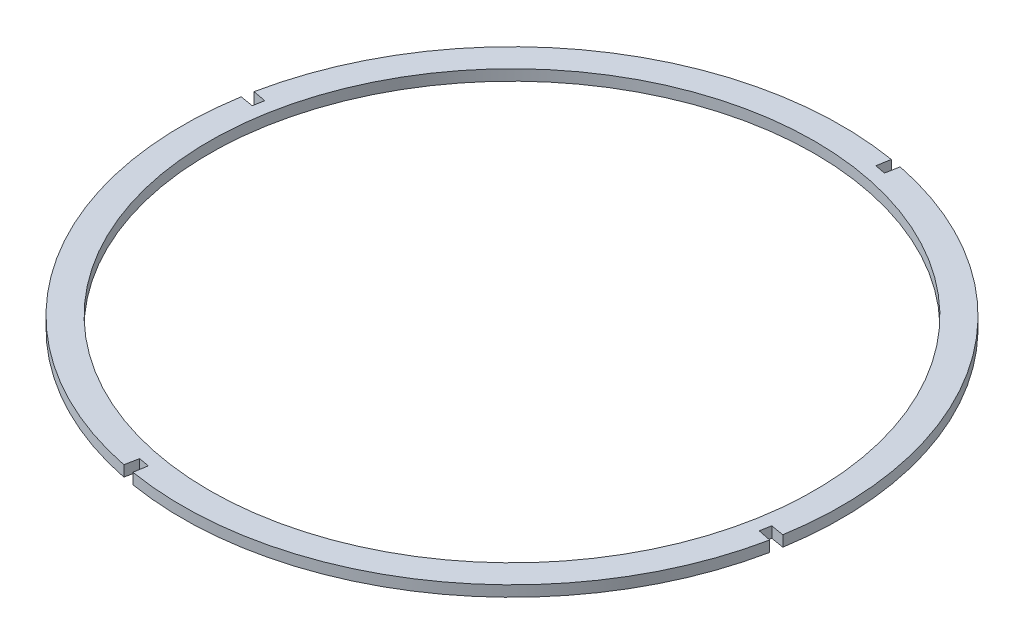
ISO-10303-21;
HEADER;
FILE_DESCRIPTION(('STEP AP214'),'2;1');
FILE_NAME('part.step','',(''),(''),'','','');
FILE_SCHEMA(('AUTOMOTIVE_DESIGN { 1 0 10303 214 1 1 1 1 }'));
ENDSEC;
DATA;
#1=APPLICATION_CONTEXT('core data for automotive mechanical design processes');
#2=APPLICATION_PROTOCOL_DEFINITION('international standard','automotive_design',2000,#1);
#3=PRODUCT_CONTEXT('',#1,'mechanical');
#4=PRODUCT('Part','Part','',(#3));
#5=PRODUCT_RELATED_PRODUCT_CATEGORY('part','',(#4));
#6=PRODUCT_DEFINITION_FORMATION('','',#4);
#7=PRODUCT_DEFINITION_CONTEXT('part definition',#1,'design');
#8=PRODUCT_DEFINITION('design','',#6,#7);
#9=PRODUCT_DEFINITION_SHAPE('','',#8);
#10=(LENGTH_UNIT() NAMED_UNIT(*) SI_UNIT(.MILLI.,.METRE.));
#11=(NAMED_UNIT(*) PLANE_ANGLE_UNIT() SI_UNIT($,.RADIAN.));
#12=(NAMED_UNIT(*) SI_UNIT($,.STERADIAN.) SOLID_ANGLE_UNIT());
#13=UNCERTAINTY_MEASURE_WITH_UNIT(LENGTH_MEASURE(1.E-05),#10,'distance_accuracy_value','');
#14=(GEOMETRIC_REPRESENTATION_CONTEXT(3) GLOBAL_UNCERTAINTY_ASSIGNED_CONTEXT((#13)) GLOBAL_UNIT_ASSIGNED_CONTEXT((#10,
#11,#12)) REPRESENTATION_CONTEXT('',''));
#15=CARTESIAN_POINT('',(0.,0.,0.));
#16=DIRECTION('',(0.,0.,1.));
#17=DIRECTION('',(1.,0.,0.));
#18=AXIS2_PLACEMENT_3D('',#15,#16,#17);
#19=CARTESIAN_POINT('',(-421.491491691804,16.,-176.360021806864));
#20=DIRECTION('',(0.,1.,0.));
#21=DIRECTION('',(0.,0.,1.));
#22=AXIS2_PLACEMENT_3D('',#19,#20,#21);
#23=PLANE('',#22);
#24=DIRECTION('',(0.164606603428678,0.,-0.986359298687691));
#25=VECTOR('',#24,1.);
#26=CARTESIAN_POINT('',(-344.329139140304,16.,-638.733962842383));
#27=LINE('',#26,#25);
#28=CARTESIAN_POINT('',(-344.329139140304,16.,-638.733962842383));
#29=VERTEX_POINT('',#28);
#30=CARTESIAN_POINT('',(-341.048244596208,16.,-658.393811075538));
#31=VERTEX_POINT('',#30);
#32=EDGE_CURVE('E242',#29,#31,#27,.T.);
#33=ORIENTED_EDGE('',*,*,#32,.T.);
#34=CARTESIAN_POINT('',(-421.491491691804,16.,-176.360021806864));
#35=DIRECTION('',(0.,1.,0.));
#36=DIRECTION('',(0.,0.,1.));
#37=AXIS2_PLACEMENT_3D('',#34,#35,#36);
#38=CIRCLE('',#37,488.7);
#39=CARTESIAN_POINT('',(-900.566511143055,16.,-272.87331486944));
#40=VERTEX_POINT('',#39);
#41=EDGE_CURVE('E130',#31,#40,#38,.T.);
#42=ORIENTED_EDGE('',*,*,#41,.T.);
#43=DIRECTION('',(0.983406473892088,0.,0.181415840287255));
#44=VECTOR('',#43,1.);
#45=CARTESIAN_POINT('',(-880.962779282727,16.,-269.256877940637));
#46=LINE('',#45,#44);
#47=CARTESIAN_POINT('',(-880.962779282727,16.,-269.256877940637));
#48=VERTEX_POINT('',#47);
#49=EDGE_CURVE('E295',#40,#48,#46,.T.);
#50=ORIENTED_EDGE('',*,*,#49,.T.);
#51=DIRECTION('',(-0.181415840287255,0.,0.983406473892088));
#52=VECTOR('',#51,1.);
#53=CARTESIAN_POINT('',(-880.962779282727,16.,-269.256877940637));
#54=LINE('',#53,#52);
#55=CARTESIAN_POINT('',(-883.865432727323,16.,-253.522374358363));
#56=VERTEX_POINT('',#55);
#57=EDGE_CURVE('E315',#48,#56,#54,.T.);
#58=ORIENTED_EDGE('',*,*,#57,.T.);
#59=DIRECTION('',(-0.986359298687691,0.,-0.164606603428678));
#60=VECTOR('',#59,1.);
#61=CARTESIAN_POINT('',(-883.865432727323,16.,-253.522374358363));
#62=LINE('',#61,#60);
#63=CARTESIAN_POINT('',(-903.525280960478,16.,-256.803268902459));
#64=VERTEX_POINT('',#63);
#65=EDGE_CURVE('E311',#56,#64,#62,.T.);
#66=ORIENTED_EDGE('',*,*,#65,.T.);
#67=CARTESIAN_POINT('',(-421.491491691804,16.,-176.360021806864));
#68=DIRECTION('',(0.,1.,0.));
#69=DIRECTION('',(0.,0.,1.));
#70=AXIS2_PLACEMENT_3D('',#67,#68,#69);
#71=CIRCLE('',#70,488.7);
#72=CARTESIAN_POINT('',(-518.061372416088,16.,302.703594153374));
#73=VERTEX_POINT('',#72);
#74=EDGE_CURVE('E314',#64,#73,#71,.T.);
#75=ORIENTED_EDGE('',*,*,#74,.T.);
#76=DIRECTION('',(0.197605649118648,0.,-0.980281595989845));
#77=VECTOR('',#76,1.);
#78=CARTESIAN_POINT('',(-514.122296759583,16.,283.162637766215));
#79=LINE('',#78,#77);
#80=CARTESIAN_POINT('',(-514.122296759583,16.,283.162637766215));
#81=VERTEX_POINT('',#80);
#82=EDGE_CURVE('E319',#73,#81,#79,.T.);
#83=ORIENTED_EDGE('',*,*,#82,.T.);
#84=DIRECTION('',(0.983458871104074,0.,0.181131578822413));
#85=VECTOR('',#84,1.);
#86=CARTESIAN_POINT('',(-514.122296759583,16.,283.162637766215));
#87=LINE('',#86,#85);
#88=CARTESIAN_POINT('',(-498.386954821918,16.,286.060743027374));
#89=VERTEX_POINT('',#88);
#90=EDGE_CURVE('E326',#81,#89,#87,.T.);
#91=ORIENTED_EDGE('',*,*,#90,.T.);
#92=DIRECTION('',(-0.164036445607693,0.,0.986454278977183));
#93=VECTOR('',#92,1.);
#94=CARTESIAN_POINT('',(-498.386954821918,16.,286.060743027374));
#95=LINE('',#94,#93);
#96=CARTESIAN_POINT('',(-501.656102660317,16.,305.72018432928));
#97=VERTEX_POINT('',#96);
#98=EDGE_CURVE('E329',#89,#97,#95,.T.);
#99=ORIENTED_EDGE('',*,*,#98,.T.);
#100=CARTESIAN_POINT('',(-421.491491691804,16.,-176.360021806864));
#101=DIRECTION('',(0.,1.,0.));
#102=DIRECTION('',(0.,0.,1.));
#103=AXIS2_PLACEMENT_3D('',#100,#101,#102);
#104=CIRCLE('',#103,488.7);
#105=CARTESIAN_POINT('',(57.51622513927,16.,-79.5132499645258));
#106=VERTEX_POINT('',#105);
#107=EDGE_CURVE('E332',#97,#106,#104,.T.);
#108=ORIENTED_EDGE('',*,*,#107,.T.);
#109=DIRECTION('',(-0.980167212668455,0.,-0.198172236223321));
#110=VECTOR('',#109,1.);
#111=CARTESIAN_POINT('',(37.9797958991198,16.,-83.4631656730905));
#112=LINE('',#111,#110);
#113=CARTESIAN_POINT('',(37.9797958991198,16.,-83.4631656730905));
#114=VERTEX_POINT('',#113);
#115=EDGE_CURVE('E335',#106,#114,#112,.T.);
#116=ORIENTED_EDGE('',*,*,#115,.T.);
#117=DIRECTION('',(0.181415840287254,0.,-0.983406473892088));
#118=VECTOR('',#117,1.);
#119=CARTESIAN_POINT('',(40.8824493437158,16.,-99.1976692553639));
#120=LINE('',#119,#118);
#121=CARTESIAN_POINT('',(40.8824493437158,16.,-99.1976692553639));
#122=VERTEX_POINT('',#121);
#123=EDGE_CURVE('E338',#114,#122,#120,.T.);
#124=ORIENTED_EDGE('',*,*,#123,.T.);
#125=DIRECTION('',(0.986359298687691,0.,0.164606603428679));
#126=VECTOR('',#125,1.);
#127=CARTESIAN_POINT('',(40.8824493437158,16.,-99.1976692553639));
#128=LINE('',#127,#126);
#129=CARTESIAN_POINT('',(60.5422975768707,16.,-95.9167747112677));
#130=VERTEX_POINT('',#129);
#131=EDGE_CURVE('E173',#122,#130,#128,.T.);
#132=ORIENTED_EDGE('',*,*,#131,.T.);
#133=CARTESIAN_POINT('',(-421.491491691804,16.,-176.360021806864));
#134=DIRECTION('',(0.,1.,0.));
#135=DIRECTION('',(0.,0.,1.));
#136=AXIS2_PLACEMENT_3D('',#133,#134,#135);
#137=CIRCLE('',#136,488.7);
#138=CARTESIAN_POINT('',(-324.978198629227,16.,-655.435041258115));
#139=VERTEX_POINT('',#138);
#140=EDGE_CURVE('E167',#130,#139,#137,.T.);
#141=ORIENTED_EDGE('',*,*,#140,.T.);
#142=DIRECTION('',(-0.181415840287261,0.,0.983406473892087));
#143=VECTOR('',#142,1.);
#144=CARTESIAN_POINT('',(-328.594635558031,16.,-635.831309397787));
#145=LINE('',#144,#143);
#146=CARTESIAN_POINT('',(-328.594635558031,16.,-635.831309397787));
#147=VERTEX_POINT('',#146);
#148=EDGE_CURVE('E171',#139,#147,#145,.T.);
#149=ORIENTED_EDGE('',*,*,#148,.T.);
#150=DIRECTION('',(-0.983406473892088,0.,-0.181415840287254));
#151=VECTOR('',#150,1.);
#152=CARTESIAN_POINT('',(-344.329139140304,16.,-638.733962842383));
#153=LINE('',#152,#151);
#154=EDGE_CURVE('E63',#147,#29,#153,.T.);
#155=ORIENTED_EDGE('',*,*,#154,.T.);
#156=EDGE_LOOP('',(#33,#42,#50,#58,#66,#75,#83,#91,#99,#108,#116,#124,#132,#141,#149,#155));
#157=FACE_BOUND('',#156,.T.);
#158=CARTESIAN_POINT('',(-421.491491691804,16.,-176.360021806864));
#159=DIRECTION('',(0.,1.,0.));
#160=DIRECTION('',(0.,0.,1.));
#161=AXIS2_PLACEMENT_3D('',#158,#159,#160);
#162=CIRCLE('',#161,448.7);
#163=CARTESIAN_POINT('',(-421.491491691804,16.,272.339978193137));
#164=VERTEX_POINT('',#163);
#165=EDGE_CURVE('E200',#164,#164,#162,.T.);
#166=ORIENTED_EDGE('',*,*,#165,.F.);
#167=EDGE_LOOP('',(#166));
#168=FACE_BOUND('',#167,.T.);
#169=ADVANCED_FACE('F45',(#157,#168),#23,.T.);
#170=CARTESIAN_POINT('',(-421.491491691804,0.,-176.360021806864));
#171=DIRECTION('',(0.,1.,0.));
#172=DIRECTION('',(0.,0.,1.));
#173=AXIS2_PLACEMENT_3D('',#170,#171,#172);
#174=PLANE('',#173);
#175=DIRECTION('',(0.164606603428678,0.,-0.986359298687691));
#176=VECTOR('',#175,1.);
#177=CARTESIAN_POINT('',(-344.329139140304,0.,-638.733962842383));
#178=LINE('',#177,#176);
#179=CARTESIAN_POINT('',(-344.329139140304,0.,-638.733962842383));
#180=VERTEX_POINT('',#179);
#181=CARTESIAN_POINT('',(-341.048244596208,0.,-658.393811075538));
#182=VERTEX_POINT('',#181);
#183=EDGE_CURVE('E195',#180,#182,#178,.T.);
#184=ORIENTED_EDGE('',*,*,#183,.F.);
#185=DIRECTION('',(-0.983406473892088,0.,-0.181415840287254));
#186=VECTOR('',#185,1.);
#187=CARTESIAN_POINT('',(-344.329139140304,0.,-638.733962842383));
#188=LINE('',#187,#186);
#189=CARTESIAN_POINT('',(-328.594635558031,0.,-635.831309397787));
#190=VERTEX_POINT('',#189);
#191=EDGE_CURVE('E122',#190,#180,#188,.T.);
#192=ORIENTED_EDGE('',*,*,#191,.F.);
#193=DIRECTION('',(-0.181415840287261,0.,0.983406473892087));
#194=VECTOR('',#193,1.);
#195=CARTESIAN_POINT('',(-328.594635558031,0.,-635.831309397787));
#196=LINE('',#195,#194);
#197=CARTESIAN_POINT('',(-324.978198629227,0.,-655.435041258115));
#198=VERTEX_POINT('',#197);
#199=EDGE_CURVE('E116',#198,#190,#196,.T.);
#200=ORIENTED_EDGE('',*,*,#199,.F.);
#201=CARTESIAN_POINT('',(-421.491491691804,0.,-176.360021806864));
#202=DIRECTION('',(0.,1.,0.));
#203=DIRECTION('',(0.,0.,1.));
#204=AXIS2_PLACEMENT_3D('',#201,#202,#203);
#205=CIRCLE('',#204,488.7);
#206=CARTESIAN_POINT('',(60.5422975768707,0.,-95.9167747112677));
#207=VERTEX_POINT('',#206);
#208=EDGE_CURVE('E182',#207,#198,#205,.T.);
#209=ORIENTED_EDGE('',*,*,#208,.F.);
#210=DIRECTION('',(0.986359298687691,0.,0.164606603428679));
#211=VECTOR('',#210,1.);
#212=CARTESIAN_POINT('',(40.8824493437158,0.,-99.1976692553639));
#213=LINE('',#212,#211);
#214=CARTESIAN_POINT('',(40.8824493437158,0.,-99.1976692553639));
#215=VERTEX_POINT('',#214);
#216=EDGE_CURVE('E233',#215,#207,#213,.T.);
#217=ORIENTED_EDGE('',*,*,#216,.F.);
#218=DIRECTION('',(0.181415840287254,0.,-0.983406473892088));
#219=VECTOR('',#218,1.);
#220=CARTESIAN_POINT('',(40.8824493437158,0.,-99.1976692553639));
#221=LINE('',#220,#219);
#222=CARTESIAN_POINT('',(37.9797958991198,0.,-83.4631656730905));
#223=VERTEX_POINT('',#222);
#224=EDGE_CURVE('E230',#223,#215,#221,.T.);
#225=ORIENTED_EDGE('',*,*,#224,.F.);
#226=DIRECTION('',(-0.980167212668455,0.,-0.198172236223321));
#227=VECTOR('',#226,1.);
#228=CARTESIAN_POINT('',(37.9797958991198,0.,-83.4631656730905));
#229=LINE('',#228,#227);
#230=CARTESIAN_POINT('',(57.51622513927,0.,-79.5132499645258));
#231=VERTEX_POINT('',#230);
#232=EDGE_CURVE('E227',#231,#223,#229,.T.);
#233=ORIENTED_EDGE('',*,*,#232,.F.);
#234=CARTESIAN_POINT('',(-421.491491691804,0.,-176.360021806864));
#235=DIRECTION('',(0.,1.,0.));
#236=DIRECTION('',(0.,0.,1.));
#237=AXIS2_PLACEMENT_3D('',#234,#235,#236);
#238=CIRCLE('',#237,488.7);
#239=CARTESIAN_POINT('',(-501.656102660317,0.,305.72018432928));
#240=VERTEX_POINT('',#239);
#241=EDGE_CURVE('E224',#240,#231,#238,.T.);
#242=ORIENTED_EDGE('',*,*,#241,.F.);
#243=DIRECTION('',(-0.164036445607693,0.,0.986454278977183));
#244=VECTOR('',#243,1.);
#245=CARTESIAN_POINT('',(-498.386954821918,0.,286.060743027374));
#246=LINE('',#245,#244);
#247=CARTESIAN_POINT('',(-498.386954821918,0.,286.060743027374));
#248=VERTEX_POINT('',#247);
#249=EDGE_CURVE('E221',#248,#240,#246,.T.);
#250=ORIENTED_EDGE('',*,*,#249,.F.);
#251=DIRECTION('',(0.983458871104074,0.,0.181131578822413));
#252=VECTOR('',#251,1.);
#253=CARTESIAN_POINT('',(-514.122296759583,0.,283.162637766215));
#254=LINE('',#253,#252);
#255=CARTESIAN_POINT('',(-514.122296759583,0.,283.162637766215));
#256=VERTEX_POINT('',#255);
#257=EDGE_CURVE('E218',#256,#248,#254,.T.);
#258=ORIENTED_EDGE('',*,*,#257,.F.);
#259=DIRECTION('',(0.197605649118648,0.,-0.980281595989845));
#260=VECTOR('',#259,1.);
#261=CARTESIAN_POINT('',(-514.122296759583,0.,283.162637766215));
#262=LINE('',#261,#260);
#263=CARTESIAN_POINT('',(-518.061372416088,0.,302.703594153374));
#264=VERTEX_POINT('',#263);
#265=EDGE_CURVE('E215',#264,#256,#262,.T.);
#266=ORIENTED_EDGE('',*,*,#265,.F.);
#267=CARTESIAN_POINT('',(-421.491491691804,0.,-176.360021806864));
#268=DIRECTION('',(0.,1.,0.));
#269=DIRECTION('',(0.,0.,1.));
#270=AXIS2_PLACEMENT_3D('',#267,#268,#269);
#271=CIRCLE('',#270,488.7);
#272=CARTESIAN_POINT('',(-903.525280960478,0.,-256.803268902459));
#273=VERTEX_POINT('',#272);
#274=EDGE_CURVE('E212',#273,#264,#271,.T.);
#275=ORIENTED_EDGE('',*,*,#274,.F.);
#276=DIRECTION('',(-0.986359298687691,0.,-0.164606603428678));
#277=VECTOR('',#276,1.);
#278=CARTESIAN_POINT('',(-883.865432727323,0.,-253.522374358363));
#279=LINE('',#278,#277);
#280=CARTESIAN_POINT('',(-883.865432727323,0.,-253.522374358363));
#281=VERTEX_POINT('',#280);
#282=EDGE_CURVE('E209',#281,#273,#279,.T.);
#283=ORIENTED_EDGE('',*,*,#282,.F.);
#284=DIRECTION('',(-0.181415840287255,0.,0.983406473892088));
#285=VECTOR('',#284,1.);
#286=CARTESIAN_POINT('',(-880.962779282727,0.,-269.256877940637));
#287=LINE('',#286,#285);
#288=CARTESIAN_POINT('',(-880.962779282727,0.,-269.256877940637));
#289=VERTEX_POINT('',#288);
#290=EDGE_CURVE('E206',#289,#281,#287,.T.);
#291=ORIENTED_EDGE('',*,*,#290,.F.);
#292=DIRECTION('',(0.983406473892088,0.,0.181415840287255));
#293=VECTOR('',#292,1.);
#294=CARTESIAN_POINT('',(-880.962779282727,0.,-269.256877940637));
#295=LINE('',#294,#293);
#296=CARTESIAN_POINT('',(-900.566511143055,0.,-272.87331486944));
#297=VERTEX_POINT('',#296);
#298=EDGE_CURVE('E203',#297,#289,#295,.T.);
#299=ORIENTED_EDGE('',*,*,#298,.F.);
#300=CARTESIAN_POINT('',(-421.491491691804,0.,-176.360021806864));
#301=DIRECTION('',(0.,1.,0.));
#302=DIRECTION('',(0.,0.,1.));
#303=AXIS2_PLACEMENT_3D('',#300,#301,#302);
#304=CIRCLE('',#303,488.7);
#305=EDGE_CURVE('E199',#182,#297,#304,.T.);
#306=ORIENTED_EDGE('',*,*,#305,.F.);
#307=EDGE_LOOP('',(#184,#192,#200,#209,#217,#225,#233,#242,#250,#258,#266,#275,#283,#291,#299,#306));
#308=FACE_BOUND('',#307,.T.);
#309=CARTESIAN_POINT('',(-421.491491691804,0.,-176.360021806864));
#310=DIRECTION('',(0.,1.,0.));
#311=DIRECTION('',(0.,0.,1.));
#312=AXIS2_PLACEMENT_3D('',#309,#310,#311);
#313=CIRCLE('',#312,448.7);
#314=CARTESIAN_POINT('',(-421.491491691804,0.,272.339978193137));
#315=VERTEX_POINT('',#314);
#316=EDGE_CURVE('E539',#315,#315,#313,.T.);
#317=ORIENTED_EDGE('',*,*,#316,.T.);
#318=EDGE_LOOP('',(#317));
#319=FACE_BOUND('',#318,.T.);
#320=ADVANCED_FACE('F299',(#308,#319),#174,.F.);
#321=CARTESIAN_POINT('',(-344.329139140304,16.,-638.733962842383));
#322=DIRECTION('',(-0.986359298687691,0.,-0.164606603428678));
#323=DIRECTION('',(-0.164606603428678,0.,0.986359298687691));
#324=AXIS2_PLACEMENT_3D('',#321,#322,#323);
#325=PLANE('',#324);
#326=ORIENTED_EDGE('',*,*,#183,.T.);
#327=DIRECTION('',(0.,-1.,0.));
#328=VECTOR('',#327,1.);
#329=CARTESIAN_POINT('',(-341.048244596208,16.,-658.393811075538));
#330=LINE('',#329,#328);
#331=EDGE_CURVE('E11',#31,#182,#330,.T.);
#332=ORIENTED_EDGE('',*,*,#331,.F.);
#333=ORIENTED_EDGE('',*,*,#32,.F.);
#334=DIRECTION('',(0.,-1.,0.));
#335=VECTOR('',#334,1.);
#336=CARTESIAN_POINT('',(-344.329139140304,16.,-638.733962842383));
#337=LINE('',#336,#335);
#338=EDGE_CURVE('E191',#29,#180,#337,.T.);
#339=ORIENTED_EDGE('',*,*,#338,.T.);
#340=EDGE_LOOP('',(#326,#332,#333,#339));
#341=FACE_BOUND('',#340,.T.);
#342=ADVANCED_FACE('F47',(#341),#325,.F.);
#343=CARTESIAN_POINT('',(-421.491491691804,16.,-176.360021806864));
#344=DIRECTION('',(0.,-1.,0.));
#345=DIRECTION('',(0.,0.,-1.));
#346=AXIS2_PLACEMENT_3D('',#343,#344,#345);
#347=CYLINDRICAL_SURFACE('',#346,488.7);
#348=ORIENTED_EDGE('',*,*,#305,.T.);
#349=DIRECTION('',(0.,-1.,0.));
#350=VECTOR('',#349,1.);
#351=CARTESIAN_POINT('',(-900.566511143055,16.,-272.87331486944));
#352=LINE('',#351,#350);
#353=EDGE_CURVE('E55',#40,#297,#352,.T.);
#354=ORIENTED_EDGE('',*,*,#353,.F.);
#355=ORIENTED_EDGE('',*,*,#41,.F.);
#356=ORIENTED_EDGE('',*,*,#331,.T.);
#357=EDGE_LOOP('',(#348,#354,#355,#356));
#358=FACE_BOUND('',#357,.T.);
#359=ADVANCED_FACE('F374',(#358),#347,.T.);
#360=CARTESIAN_POINT('',(-880.962779282727,16.,-269.256877940637));
#361=DIRECTION('',(0.181415840287255,0.,-0.983406473892088));
#362=DIRECTION('',(-0.983406473892088,0.,-0.181415840287255));
#363=AXIS2_PLACEMENT_3D('',#360,#361,#362);
#364=PLANE('',#363);
#365=ORIENTED_EDGE('',*,*,#298,.T.);
#366=DIRECTION('',(0.,-1.,0.));
#367=VECTOR('',#366,1.);
#368=CARTESIAN_POINT('',(-880.962779282727,16.,-269.256877940637));
#369=LINE('',#368,#367);
#370=EDGE_CURVE('E285',#48,#289,#369,.T.);
#371=ORIENTED_EDGE('',*,*,#370,.F.);
#372=ORIENTED_EDGE('',*,*,#49,.F.);
#373=ORIENTED_EDGE('',*,*,#353,.T.);
#374=EDGE_LOOP('',(#365,#371,#372,#373));
#375=FACE_BOUND('',#374,.T.);
#376=ADVANCED_FACE('F293',(#375),#364,.F.);
#377=CARTESIAN_POINT('',(-880.962779282727,16.,-269.256877940637));
#378=DIRECTION('',(0.983406473892088,0.,0.181415840287255));
#379=DIRECTION('',(0.181415840287255,0.,-0.983406473892088));
#380=AXIS2_PLACEMENT_3D('',#377,#378,#379);
#381=PLANE('',#380);
#382=ORIENTED_EDGE('',*,*,#290,.T.);
#383=DIRECTION('',(0.,-1.,0.));
#384=VECTOR('',#383,1.);
#385=CARTESIAN_POINT('',(-883.865432727323,16.,-253.522374358363));
#386=LINE('',#385,#384);
#387=EDGE_CURVE('E281',#56,#281,#386,.T.);
#388=ORIENTED_EDGE('',*,*,#387,.F.);
#389=ORIENTED_EDGE('',*,*,#57,.F.);
#390=ORIENTED_EDGE('',*,*,#370,.T.);
#391=EDGE_LOOP('',(#382,#388,#389,#390));
#392=FACE_BOUND('',#391,.T.);
#393=ADVANCED_FACE('F305',(#392),#381,.F.);
#394=CARTESIAN_POINT('',(-883.865432727323,16.,-253.522374358363));
#395=DIRECTION('',(-0.164606603428678,0.,0.986359298687691));
#396=DIRECTION('',(0.986359298687691,0.,0.164606603428678));
#397=AXIS2_PLACEMENT_3D('',#394,#395,#396);
#398=PLANE('',#397);
#399=ORIENTED_EDGE('',*,*,#282,.T.);
#400=DIRECTION('',(0.,-1.,0.));
#401=VECTOR('',#400,1.);
#402=CARTESIAN_POINT('',(-903.525280960478,16.,-256.803268902459));
#403=LINE('',#402,#401);
#404=EDGE_CURVE('E277',#64,#273,#403,.T.);
#405=ORIENTED_EDGE('',*,*,#404,.F.);
#406=ORIENTED_EDGE('',*,*,#65,.F.);
#407=ORIENTED_EDGE('',*,*,#387,.T.);
#408=EDGE_LOOP('',(#399,#405,#406,#407));
#409=FACE_BOUND('',#408,.T.);
#410=ADVANCED_FACE('F309',(#409),#398,.F.);
#411=CARTESIAN_POINT('',(-421.491491691804,16.,-176.360021806864));
#412=DIRECTION('',(0.,-1.,0.));
#413=DIRECTION('',(0.,0.,-1.));
#414=AXIS2_PLACEMENT_3D('',#411,#412,#413);
#415=CYLINDRICAL_SURFACE('',#414,488.7);
#416=ORIENTED_EDGE('',*,*,#274,.T.);
#417=DIRECTION('',(0.,-1.,0.));
#418=VECTOR('',#417,1.);
#419=CARTESIAN_POINT('',(-518.061372416088,16.,302.703594153374));
#420=LINE('',#419,#418);
#421=EDGE_CURVE('E273',#73,#264,#420,.T.);
#422=ORIENTED_EDGE('',*,*,#421,.F.);
#423=ORIENTED_EDGE('',*,*,#74,.F.);
#424=ORIENTED_EDGE('',*,*,#404,.T.);
#425=EDGE_LOOP('',(#416,#422,#423,#424));
#426=FACE_BOUND('',#425,.T.);
#427=ADVANCED_FACE('F387',(#426),#415,.T.);
#428=CARTESIAN_POINT('',(-514.122296759583,16.,283.162637766215));
#429=DIRECTION('',(-0.980281595989845,0.,-0.197605649118648));
#430=DIRECTION('',(-0.197605649118648,0.,0.980281595989845));
#431=AXIS2_PLACEMENT_3D('',#428,#429,#430);
#432=PLANE('',#431);
#433=ORIENTED_EDGE('',*,*,#265,.T.);
#434=DIRECTION('',(0.,-1.,0.));
#435=VECTOR('',#434,1.);
#436=CARTESIAN_POINT('',(-514.122296759583,16.,283.162637766215));
#437=LINE('',#436,#435);
#438=EDGE_CURVE('E269',#81,#256,#437,.T.);
#439=ORIENTED_EDGE('',*,*,#438,.F.);
#440=ORIENTED_EDGE('',*,*,#82,.F.);
#441=ORIENTED_EDGE('',*,*,#421,.T.);
#442=EDGE_LOOP('',(#433,#439,#440,#441));
#443=FACE_BOUND('',#442,.T.);
#444=ADVANCED_FACE('F390',(#443),#432,.F.);
#445=CARTESIAN_POINT('',(-514.122296759583,16.,283.162637766215));
#446=DIRECTION('',(0.181131578822413,0.,-0.983458871104074));
#447=DIRECTION('',(-0.983458871104074,0.,-0.181131578822413));
#448=AXIS2_PLACEMENT_3D('',#445,#446,#447);
#449=PLANE('',#448);
#450=ORIENTED_EDGE('',*,*,#257,.T.);
#451=DIRECTION('',(0.,-1.,0.));
#452=VECTOR('',#451,1.);
#453=CARTESIAN_POINT('',(-498.386954821918,16.,286.060743027374));
#454=LINE('',#453,#452);
#455=EDGE_CURVE('E265',#89,#248,#454,.T.);
#456=ORIENTED_EDGE('',*,*,#455,.F.);
#457=ORIENTED_EDGE('',*,*,#90,.F.);
#458=ORIENTED_EDGE('',*,*,#438,.T.);
#459=EDGE_LOOP('',(#450,#456,#457,#458));
#460=FACE_BOUND('',#459,.T.);
#461=ADVANCED_FACE('F394',(#460),#449,.F.);
#462=CARTESIAN_POINT('',(-498.386954821918,16.,286.060743027374));
#463=DIRECTION('',(0.986454278977183,0.,0.164036445607693));
#464=DIRECTION('',(0.164036445607693,0.,-0.986454278977183));
#465=AXIS2_PLACEMENT_3D('',#462,#463,#464);
#466=PLANE('',#465);
#467=ORIENTED_EDGE('',*,*,#249,.T.);
#468=DIRECTION('',(0.,-1.,0.));
#469=VECTOR('',#468,1.);
#470=CARTESIAN_POINT('',(-501.656102660317,16.,305.72018432928));
#471=LINE('',#470,#469);
#472=EDGE_CURVE('E261',#97,#240,#471,.T.);
#473=ORIENTED_EDGE('',*,*,#472,.F.);
#474=ORIENTED_EDGE('',*,*,#98,.F.);
#475=ORIENTED_EDGE('',*,*,#455,.T.);
#476=EDGE_LOOP('',(#467,#473,#474,#475));
#477=FACE_BOUND('',#476,.T.);
#478=ADVANCED_FACE('F398',(#477),#466,.F.);
#479=CARTESIAN_POINT('',(-421.491491691804,16.,-176.360021806864));
#480=DIRECTION('',(0.,-1.,0.));
#481=DIRECTION('',(0.,0.,-1.));
#482=AXIS2_PLACEMENT_3D('',#479,#480,#481);
#483=CYLINDRICAL_SURFACE('',#482,488.7);
#484=ORIENTED_EDGE('',*,*,#241,.T.);
#485=DIRECTION('',(0.,-1.,0.));
#486=VECTOR('',#485,1.);
#487=CARTESIAN_POINT('',(57.51622513927,16.,-79.5132499645258));
#488=LINE('',#487,#486);
#489=EDGE_CURVE('E257',#106,#231,#488,.T.);
#490=ORIENTED_EDGE('',*,*,#489,.F.);
#491=ORIENTED_EDGE('',*,*,#107,.F.);
#492=ORIENTED_EDGE('',*,*,#472,.T.);
#493=EDGE_LOOP('',(#484,#490,#491,#492));
#494=FACE_BOUND('',#493,.T.);
#495=ADVANCED_FACE('F402',(#494),#483,.T.);
#496=CARTESIAN_POINT('',(37.9797958991198,16.,-83.4631656730905));
#497=DIRECTION('',(-0.198172236223321,0.,0.980167212668455));
#498=DIRECTION('',(0.980167212668455,0.,0.198172236223321));
#499=AXIS2_PLACEMENT_3D('',#496,#497,#498);
#500=PLANE('',#499);
#501=ORIENTED_EDGE('',*,*,#232,.T.);
#502=DIRECTION('',(0.,-1.,0.));
#503=VECTOR('',#502,1.);
#504=CARTESIAN_POINT('',(37.9797958991198,16.,-83.4631656730905));
#505=LINE('',#504,#503);
#506=EDGE_CURVE('E253',#114,#223,#505,.T.);
#507=ORIENTED_EDGE('',*,*,#506,.F.);
#508=ORIENTED_EDGE('',*,*,#115,.F.);
#509=ORIENTED_EDGE('',*,*,#489,.T.);
#510=EDGE_LOOP('',(#501,#507,#508,#509));
#511=FACE_BOUND('',#510,.T.);
#512=ADVANCED_FACE('F406',(#511),#500,.F.);
#513=CARTESIAN_POINT('',(40.8824493437158,16.,-99.1976692553639));
#514=DIRECTION('',(-0.983406473892088,0.,-0.181415840287254));
#515=DIRECTION('',(-0.181415840287254,0.,0.983406473892088));
#516=AXIS2_PLACEMENT_3D('',#513,#514,#515);
#517=PLANE('',#516);
#518=ORIENTED_EDGE('',*,*,#224,.T.);
#519=DIRECTION('',(0.,-1.,0.));
#520=VECTOR('',#519,1.);
#521=CARTESIAN_POINT('',(40.8824493437158,16.,-99.1976692553639));
#522=LINE('',#521,#520);
#523=EDGE_CURVE('E249',#122,#215,#522,.T.);
#524=ORIENTED_EDGE('',*,*,#523,.F.);
#525=ORIENTED_EDGE('',*,*,#123,.F.);
#526=ORIENTED_EDGE('',*,*,#506,.T.);
#527=EDGE_LOOP('',(#518,#524,#525,#526));
#528=FACE_BOUND('',#527,.T.);
#529=ADVANCED_FACE('F346',(#528),#517,.F.);
#530=CARTESIAN_POINT('',(40.8824493437158,16.,-99.1976692553639));
#531=DIRECTION('',(0.164606603428679,0.,-0.986359298687691));
#532=DIRECTION('',(-0.986359298687691,0.,-0.164606603428679));
#533=AXIS2_PLACEMENT_3D('',#530,#531,#532);
#534=PLANE('',#533);
#535=ORIENTED_EDGE('',*,*,#216,.T.);
#536=DIRECTION('',(0.,-1.,0.));
#537=VECTOR('',#536,1.);
#538=CARTESIAN_POINT('',(60.5422975768707,16.,-95.9167747112677));
#539=LINE('',#538,#537);
#540=EDGE_CURVE('E184',#130,#207,#539,.T.);
#541=ORIENTED_EDGE('',*,*,#540,.F.);
#542=ORIENTED_EDGE('',*,*,#131,.F.);
#543=ORIENTED_EDGE('',*,*,#523,.T.);
#544=EDGE_LOOP('',(#535,#541,#542,#543));
#545=FACE_BOUND('',#544,.T.);
#546=ADVANCED_FACE('F350',(#545),#534,.F.);
#547=CARTESIAN_POINT('',(-421.491491691804,16.,-176.360021806864));
#548=DIRECTION('',(0.,-1.,0.));
#549=DIRECTION('',(0.,0.,-1.));
#550=AXIS2_PLACEMENT_3D('',#547,#548,#549);
#551=CYLINDRICAL_SURFACE('',#550,488.7);
#552=ORIENTED_EDGE('',*,*,#208,.T.);
#553=DIRECTION('',(0.,-1.,0.));
#554=VECTOR('',#553,1.);
#555=CARTESIAN_POINT('',(-324.978198629227,16.,-655.435041258115));
#556=LINE('',#555,#554);
#557=EDGE_CURVE('E179',#139,#198,#556,.T.);
#558=ORIENTED_EDGE('',*,*,#557,.F.);
#559=ORIENTED_EDGE('',*,*,#140,.F.);
#560=ORIENTED_EDGE('',*,*,#540,.T.);
#561=EDGE_LOOP('',(#552,#558,#559,#560));
#562=FACE_BOUND('',#561,.T.);
#563=ADVANCED_FACE('F180',(#562),#551,.T.);
#564=CARTESIAN_POINT('',(-328.594635558031,16.,-635.831309397787));
#565=DIRECTION('',(0.983406473892087,0.,0.181415840287261));
#566=DIRECTION('',(0.181415840287261,0.,-0.983406473892087));
#567=AXIS2_PLACEMENT_3D('',#564,#565,#566);
#568=PLANE('',#567);
#569=ORIENTED_EDGE('',*,*,#199,.T.);
#570=DIRECTION('',(0.,-1.,0.));
#571=VECTOR('',#570,1.);
#572=CARTESIAN_POINT('',(-328.594635558031,16.,-635.831309397787));
#573=LINE('',#572,#571);
#574=EDGE_CURVE('E185',#147,#190,#573,.T.);
#575=ORIENTED_EDGE('',*,*,#574,.F.);
#576=ORIENTED_EDGE('',*,*,#148,.F.);
#577=ORIENTED_EDGE('',*,*,#557,.T.);
#578=EDGE_LOOP('',(#569,#575,#576,#577));
#579=FACE_BOUND('',#578,.T.);
#580=ADVANCED_FACE('F187',(#579),#568,.F.);
#581=CARTESIAN_POINT('',(-344.329139140304,16.,-638.733962842383));
#582=DIRECTION('',(-0.181415840287254,0.,0.983406473892088));
#583=DIRECTION('',(0.983406473892088,0.,0.181415840287254));
#584=AXIS2_PLACEMENT_3D('',#581,#582,#583);
#585=PLANE('',#584);
#586=ORIENTED_EDGE('',*,*,#191,.T.);
#587=ORIENTED_EDGE('',*,*,#338,.F.);
#588=ORIENTED_EDGE('',*,*,#154,.F.);
#589=ORIENTED_EDGE('',*,*,#574,.T.);
#590=EDGE_LOOP('',(#586,#587,#588,#589));
#591=FACE_BOUND('',#590,.T.);
#592=ADVANCED_FACE('F354',(#591),#585,.F.);
#593=CARTESIAN_POINT('',(-421.491491691804,16.,-176.360021806864));
#594=DIRECTION('',(0.,-1.,0.));
#595=DIRECTION('',(0.,0.,-1.));
#596=AXIS2_PLACEMENT_3D('',#593,#594,#595);
#597=CYLINDRICAL_SURFACE('',#596,448.7);
#598=ORIENTED_EDGE('',*,*,#165,.T.);
#599=EDGE_LOOP('',(#598));
#600=FACE_BOUND('',#599,.T.);
#601=ORIENTED_EDGE('',*,*,#316,.F.);
#602=EDGE_LOOP('',(#601));
#603=FACE_BOUND('',#602,.T.);
#604=ADVANCED_FACE('F356',(#600,#603),#597,.F.);
#605=CLOSED_SHELL('',(#169,#320,#342,#359,#376,#393,#410,#427,#444,#461,#478,#495,#512,#529,
#546,#563,#580,#592,#604));
#606=MANIFOLD_SOLID_BREP('B2',#605);
#607=ADVANCED_BREP_SHAPE_REPRESENTATION('',(#18,#606),#14);
#608=SHAPE_DEFINITION_REPRESENTATION(#9,#607);
ENDSEC;
END-ISO-10303-21;
